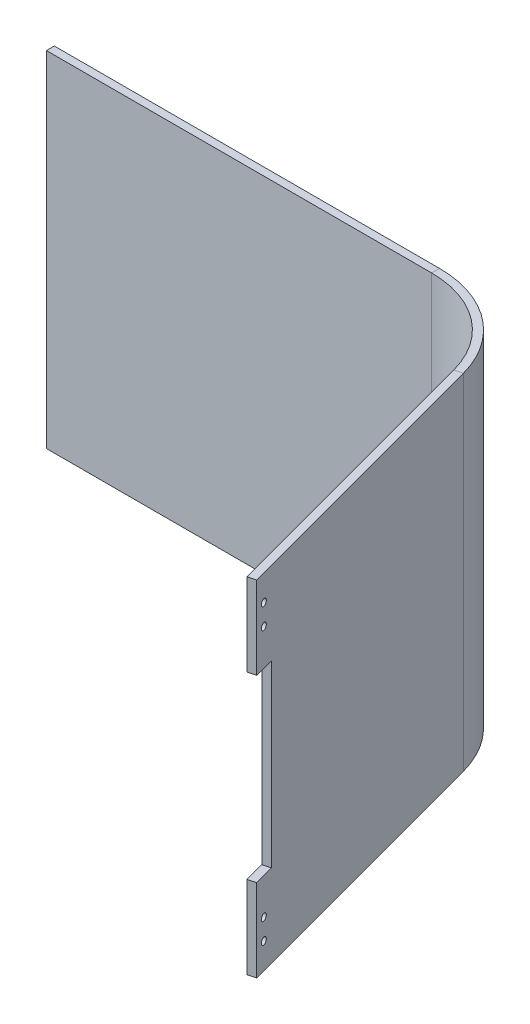
ISO-10303-21;
HEADER;
FILE_DESCRIPTION(('STEP AP214'),'2;1');
FILE_NAME('part.step','',(''),(''),'','','');
FILE_SCHEMA(('AUTOMOTIVE_DESIGN { 1 0 10303 214 1 1 1 1 }'));
ENDSEC;
DATA;
#1=APPLICATION_CONTEXT('core data for automotive mechanical design processes');
#2=APPLICATION_PROTOCOL_DEFINITION('international standard','automotive_design',2000,#1);
#3=PRODUCT_CONTEXT('',#1,'mechanical');
#4=PRODUCT('Part','Part','',(#3));
#5=PRODUCT_RELATED_PRODUCT_CATEGORY('part','',(#4));
#6=PRODUCT_DEFINITION_FORMATION('','',#4);
#7=PRODUCT_DEFINITION_CONTEXT('part definition',#1,'design');
#8=PRODUCT_DEFINITION('design','',#6,#7);
#9=PRODUCT_DEFINITION_SHAPE('','',#8);
#10=(LENGTH_UNIT() NAMED_UNIT(*) SI_UNIT(.MILLI.,.METRE.));
#11=(NAMED_UNIT(*) PLANE_ANGLE_UNIT() SI_UNIT($,.RADIAN.));
#12=(NAMED_UNIT(*) SI_UNIT($,.STERADIAN.) SOLID_ANGLE_UNIT());
#13=UNCERTAINTY_MEASURE_WITH_UNIT(LENGTH_MEASURE(1.E-05),#10,'distance_accuracy_value','');
#14=(GEOMETRIC_REPRESENTATION_CONTEXT(3) GLOBAL_UNCERTAINTY_ASSIGNED_CONTEXT((#13)) GLOBAL_UNIT_ASSIGNED_CONTEXT((#10,
#11,#12)) REPRESENTATION_CONTEXT('',''));
#15=CARTESIAN_POINT('',(0.,0.,0.));
#16=DIRECTION('',(0.,0.,1.));
#17=DIRECTION('',(1.,0.,0.));
#18=AXIS2_PLACEMENT_3D('',#15,#16,#17);
#19=CARTESIAN_POINT('',(177.873428038047,0.,-217.199269024253));
#20=DIRECTION('',(0.965925826289069,0.,-0.258819045102518));
#21=DIRECTION('',(-0.258819045102518,0.,-0.965925826289069));
#22=AXIS2_PLACEMENT_3D('',#19,#20,#21);
#23=PLANE('',#22);
#24=CARTESIAN_POINT('',(282.811609874865,151.4,174.43535724466));
#25=DIRECTION('',(-0.965925826289069,0.,0.258819045102518));
#26=DIRECTION('',(-0.258819045102518,0.,-0.965925826289069));
#27=AXIS2_PLACEMENT_3D('',#24,#25,#26);
#28=CIRCLE('',#27,1.75000000000002);
#29=CARTESIAN_POINT('',(282.358676545936,151.4,172.744987048654));
#30=VERTEX_POINT('',#29);
#31=EDGE_CURVE('E198',#30,#30,#28,.T.);
#32=ORIENTED_EDGE('',*,*,#31,.T.);
#33=EDGE_LOOP('',(#32));
#34=FACE_BOUND('',#33,.T.);
#35=CARTESIAN_POINT('',(282.811609874865,161.9,174.43535724466));
#36=DIRECTION('',(-0.965925826289069,0.,0.258819045102518));
#37=DIRECTION('',(-0.258819045102518,0.,-0.965925826289069));
#38=AXIS2_PLACEMENT_3D('',#35,#36,#37);
#39=CIRCLE('',#38,1.75000000000002);
#40=CARTESIAN_POINT('',(282.358676545936,161.9,172.744987048654));
#41=VERTEX_POINT('',#40);
#42=EDGE_CURVE('E202',#41,#41,#39,.T.);
#43=ORIENTED_EDGE('',*,*,#42,.T.);
#44=EDGE_LOOP('',(#43));
#45=FACE_BOUND('',#44,.T.);
#46=CARTESIAN_POINT('',(282.811609874865,23.6000000000002,174.43535724466));
#47=DIRECTION('',(0.965925826289069,0.,-0.258819045102518));
#48=DIRECTION('',(-0.258819045102518,0.,-0.965925826289069));
#49=AXIS2_PLACEMENT_3D('',#46,#47,#48);
#50=CIRCLE('',#49,1.75000000000002);
#51=CARTESIAN_POINT('',(282.358676545936,23.6000000000002,172.744987048654));
#52=VERTEX_POINT('',#51);
#53=EDGE_CURVE('E206',#52,#52,#50,.T.);
#54=ORIENTED_EDGE('',*,*,#53,.F.);
#55=EDGE_LOOP('',(#54));
#56=FACE_BOUND('',#55,.T.);
#57=CARTESIAN_POINT('',(282.811609874865,13.1000000000002,174.43535724466));
#58=DIRECTION('',(0.965925826289069,0.,-0.258819045102518));
#59=DIRECTION('',(-0.258819045102518,0.,-0.965925826289069));
#60=AXIS2_PLACEMENT_3D('',#57,#58,#59);
#61=CIRCLE('',#60,1.75000000000002);
#62=CARTESIAN_POINT('',(282.358676545936,13.1000000000002,172.744987048654));
#63=VERTEX_POINT('',#62);
#64=EDGE_CURVE('E210',#63,#63,#61,.T.);
#65=ORIENTED_EDGE('',*,*,#64,.F.);
#66=EDGE_LOOP('',(#65));
#67=FACE_BOUND('',#66,.T.);
#68=DIRECTION('',(0.,-1.,0.));
#69=VECTOR('',#68,1.);
#70=CARTESIAN_POINT('',(284.144527957141,0.,179.409875250039));
#71=LINE('',#70,#69);
#72=CARTESIAN_POINT('',(284.144527957141,175.,179.409875250039));
#73=VERTEX_POINT('',#72);
#74=CARTESIAN_POINT('',(284.144527957141,133.05,179.409875250039));
#75=VERTEX_POINT('',#74);
#76=EDGE_CURVE('E225',#73,#75,#71,.T.);
#77=ORIENTED_EDGE('',*,*,#76,.T.);
#78=DIRECTION('',(-0.258819045102518,0.,-0.965925826289069));
#79=VECTOR('',#78,1.);
#80=CARTESIAN_POINT('',(177.873428038047,133.05,-217.199269024253));
#81=LINE('',#80,#79);
#82=CARTESIAN_POINT('',(281.401046079054,133.05,169.171061491375));
#83=VERTEX_POINT('',#82);
#84=EDGE_CURVE('E179',#83,#75,#81,.F.);
#85=ORIENTED_EDGE('',*,*,#84,.F.);
#86=DIRECTION('',(0.,1.,0.));
#87=VECTOR('',#86,1.);
#88=CARTESIAN_POINT('',(281.401046079054,0.,169.171061491375));
#89=LINE('',#88,#87);
#90=CARTESIAN_POINT('',(281.401046079054,41.9499999999998,169.171061491375));
#91=VERTEX_POINT('',#90);
#92=EDGE_CURVE('E241',#91,#83,#89,.T.);
#93=ORIENTED_EDGE('',*,*,#92,.F.);
#94=DIRECTION('',(-0.258819045102518,0.,-0.965925826289069));
#95=VECTOR('',#94,1.);
#96=CARTESIAN_POINT('',(177.873428038047,41.9499999999998,-217.199269024253));
#97=LINE('',#96,#95);
#98=CARTESIAN_POINT('',(284.144527957141,41.9499999999998,179.409875250039));
#99=VERTEX_POINT('',#98);
#100=EDGE_CURVE('E190',#99,#91,#97,.T.);
#101=ORIENTED_EDGE('',*,*,#100,.F.);
#102=CARTESIAN_POINT('',(284.144527957141,0.,179.409875250039));
#103=VERTEX_POINT('',#102);
#104=EDGE_CURVE('E240',#99,#103,#71,.T.);
#105=ORIENTED_EDGE('',*,*,#104,.T.);
#106=DIRECTION('',(0.258819045102518,0.,0.965925826289069));
#107=VECTOR('',#106,1.);
#108=CARTESIAN_POINT('',(177.873428038047,0.,-217.199269024253));
#109=LINE('',#108,#107);
#110=CARTESIAN_POINT('',(245.724337268746,0.,36.023771564464));
#111=VERTEX_POINT('',#110);
#112=EDGE_CURVE('E267',#111,#103,#109,.T.);
#113=ORIENTED_EDGE('',*,*,#112,.F.);
#114=DIRECTION('',(0.,1.,0.));
#115=VECTOR('',#114,1.);
#116=CARTESIAN_POINT('',(245.724337268746,0.,36.023771564464));
#117=LINE('',#116,#115);
#118=CARTESIAN_POINT('',(245.724337268746,175.,36.023771564464));
#119=VERTEX_POINT('',#118);
#120=EDGE_CURVE('E258',#111,#119,#117,.T.);
#121=ORIENTED_EDGE('',*,*,#120,.T.);
#122=DIRECTION('',(-0.258819045102518,0.,-0.965925826289069));
#123=VECTOR('',#122,1.);
#124=CARTESIAN_POINT('',(177.873428038047,175.,-217.199269024253));
#125=LINE('',#124,#123);
#126=EDGE_CURVE('E253',#73,#119,#125,.T.);
#127=ORIENTED_EDGE('',*,*,#126,.F.);
#128=EDGE_LOOP('',(#77,#85,#93,#101,#105,#113,#121,#127));
#129=FACE_BOUND('',#128,.T.);
#130=ADVANCED_FACE('F58',(#34,#45,#56,#67,#129),#23,.T.);
#131=CARTESIAN_POINT('',(174.009724732891,0.,-216.163992843842));
#132=DIRECTION('',(0.965925826289069,0.,-0.258819045102518));
#133=DIRECTION('',(-0.258819045102518,0.,-0.965925826289069));
#134=AXIS2_PLACEMENT_3D('',#131,#132,#133);
#135=PLANE('',#134);
#136=CARTESIAN_POINT('',(278.947906569709,151.4,175.47063342507));
#137=DIRECTION('',(0.965925826289069,0.,-0.258819045102518));
#138=DIRECTION('',(-0.258819045102518,0.,-0.965925826289069));
#139=AXIS2_PLACEMENT_3D('',#136,#137,#138);
#140=CIRCLE('',#139,1.75000000000002);
#141=CARTESIAN_POINT('',(278.49497324078,151.4,173.780263229064));
#142=VERTEX_POINT('',#141);
#143=EDGE_CURVE('E62',#142,#142,#140,.F.);
#144=ORIENTED_EDGE('',*,*,#143,.F.);
#145=EDGE_LOOP('',(#144));
#146=FACE_BOUND('',#145,.T.);
#147=CARTESIAN_POINT('',(278.947906569709,161.9,175.47063342507));
#148=DIRECTION('',(0.965925826289069,0.,-0.258819045102518));
#149=DIRECTION('',(-0.258819045102518,0.,-0.965925826289069));
#150=AXIS2_PLACEMENT_3D('',#147,#148,#149);
#151=CIRCLE('',#150,1.75000000000002);
#152=CARTESIAN_POINT('',(278.49497324078,161.9,173.780263229064));
#153=VERTEX_POINT('',#152);
#154=EDGE_CURVE('E205',#153,#153,#151,.F.);
#155=ORIENTED_EDGE('',*,*,#154,.F.);
#156=EDGE_LOOP('',(#155));
#157=FACE_BOUND('',#156,.T.);
#158=CARTESIAN_POINT('',(278.947906569709,23.6000000000002,175.47063342507));
#159=DIRECTION('',(0.965925826289069,0.,-0.258819045102518));
#160=DIRECTION('',(-0.258819045102518,0.,-0.965925826289069));
#161=AXIS2_PLACEMENT_3D('',#158,#159,#160);
#162=CIRCLE('',#161,1.75000000000002);
#163=CARTESIAN_POINT('',(278.49497324078,23.6000000000002,173.780263229064));
#164=VERTEX_POINT('',#163);
#165=EDGE_CURVE('E209',#164,#164,#162,.T.);
#166=ORIENTED_EDGE('',*,*,#165,.T.);
#167=EDGE_LOOP('',(#166));
#168=FACE_BOUND('',#167,.T.);
#169=CARTESIAN_POINT('',(278.947906569709,13.1000000000002,175.47063342507));
#170=DIRECTION('',(0.965925826289069,0.,-0.258819045102518));
#171=DIRECTION('',(-0.258819045102518,0.,-0.965925826289069));
#172=AXIS2_PLACEMENT_3D('',#169,#170,#171);
#173=CIRCLE('',#172,1.75000000000002);
#174=CARTESIAN_POINT('',(278.49497324078,13.1000000000002,173.780263229064));
#175=VERTEX_POINT('',#174);
#176=EDGE_CURVE('E213',#175,#175,#173,.T.);
#177=ORIENTED_EDGE('',*,*,#176,.T.);
#178=EDGE_LOOP('',(#177));
#179=FACE_BOUND('',#178,.T.);
#180=DIRECTION('',(0.258819045102518,0.,0.965925826289069));
#181=VECTOR('',#180,1.);
#182=CARTESIAN_POINT('',(174.009724732891,133.05,-216.163992843842));
#183=LINE('',#182,#181);
#184=CARTESIAN_POINT('',(277.537342773898,133.05,170.206337671785));
#185=VERTEX_POINT('',#184);
#186=CARTESIAN_POINT('',(280.280824651984,133.05,180.445151430449));
#187=VERTEX_POINT('',#186);
#188=EDGE_CURVE('E182',#185,#187,#183,.T.);
#189=ORIENTED_EDGE('',*,*,#188,.T.);
#190=DIRECTION('',(0.,-1.,0.));
#191=VECTOR('',#190,1.);
#192=CARTESIAN_POINT('',(280.280824651984,0.,180.445151430449));
#193=LINE('',#192,#191);
#194=CARTESIAN_POINT('',(280.280824651984,175.,180.445151430449));
#195=VERTEX_POINT('',#194);
#196=EDGE_CURVE('E255',#195,#187,#193,.T.);
#197=ORIENTED_EDGE('',*,*,#196,.F.);
#198=DIRECTION('',(-0.258819045102518,0.,-0.965925826289069));
#199=VECTOR('',#198,1.);
#200=CARTESIAN_POINT('',(174.009724732891,175.,-216.163992843842));
#201=LINE('',#200,#199);
#202=CARTESIAN_POINT('',(241.86063396359,175.,37.0590477448741));
#203=VERTEX_POINT('',#202);
#204=EDGE_CURVE('E268',#195,#203,#201,.T.);
#205=ORIENTED_EDGE('',*,*,#204,.T.);
#206=DIRECTION('',(0.,1.,0.));
#207=VECTOR('',#206,1.);
#208=CARTESIAN_POINT('',(241.86063396359,0.,37.0590477448741));
#209=LINE('',#208,#207);
#210=CARTESIAN_POINT('',(241.86063396359,0.,37.0590477448741));
#211=VERTEX_POINT('',#210);
#212=EDGE_CURVE('E67',#211,#203,#209,.T.);
#213=ORIENTED_EDGE('',*,*,#212,.F.);
#214=DIRECTION('',(0.258819045102518,0.,0.965925826289069));
#215=VECTOR('',#214,1.);
#216=CARTESIAN_POINT('',(174.009724732891,0.,-216.163992843842));
#217=LINE('',#216,#215);
#218=CARTESIAN_POINT('',(280.280824651984,0.,180.445151430449));
#219=VERTEX_POINT('',#218);
#220=EDGE_CURVE('E247',#211,#219,#217,.T.);
#221=ORIENTED_EDGE('',*,*,#220,.T.);
#222=DIRECTION('',(0.,-1.,0.));
#223=VECTOR('',#222,1.);
#224=CARTESIAN_POINT('',(280.280824651984,0.,180.445151430449));
#225=LINE('',#224,#223);
#226=CARTESIAN_POINT('',(280.280824651984,41.9499999999998,180.445151430449));
#227=VERTEX_POINT('',#226);
#228=EDGE_CURVE('E250',#227,#219,#225,.T.);
#229=ORIENTED_EDGE('',*,*,#228,.F.);
#230=DIRECTION('',(-0.258819045102518,0.,-0.965925826289069));
#231=VECTOR('',#230,1.);
#232=CARTESIAN_POINT('',(174.009724732891,41.9500000000001,-216.163992843842));
#233=LINE('',#232,#231);
#234=CARTESIAN_POINT('',(277.537342773898,41.9499999999998,170.206337671785));
#235=VERTEX_POINT('',#234);
#236=EDGE_CURVE('E75',#227,#235,#233,.T.);
#237=ORIENTED_EDGE('',*,*,#236,.T.);
#238=DIRECTION('',(0.,1.,0.));
#239=VECTOR('',#238,1.);
#240=CARTESIAN_POINT('',(277.537342773898,0.,170.206337671785));
#241=LINE('',#240,#239);
#242=EDGE_CURVE('E252',#235,#185,#241,.T.);
#243=ORIENTED_EDGE('',*,*,#242,.T.);
#244=EDGE_LOOP('',(#189,#197,#205,#213,#221,#229,#237,#243));
#245=FACE_BOUND('',#244,.T.);
#246=ADVANCED_FACE('F283',(#146,#157,#168,#179,#245),#135,.F.);
#247=CARTESIAN_POINT('',(134.426024882335,0.,219.526827240929));
#248=DIRECTION('',(0.258819045102518,0.,0.965925826289069));
#249=DIRECTION('',(0.965925826289069,0.,-0.258819045102518));
#250=AXIS2_PLACEMENT_3D('',#247,#248,#249);
#251=PLANE('',#250);
#252=ORIENTED_EDGE('',*,*,#196,.T.);
#253=DIRECTION('',(-0.965925826289069,0.,0.258819045102518));
#254=VECTOR('',#253,1.);
#255=CARTESIAN_POINT('',(280.280824651984,133.05,180.445151430449));
#256=LINE('',#255,#254);
#257=EDGE_CURVE('E185',#187,#75,#256,.F.);
#258=ORIENTED_EDGE('',*,*,#257,.T.);
#259=ORIENTED_EDGE('',*,*,#76,.F.);
#260=DIRECTION('',(0.965925826289069,0.,-0.258819045102518));
#261=VECTOR('',#260,1.);
#262=CARTESIAN_POINT('',(134.426024882335,175.,219.526827240929));
#263=LINE('',#262,#261);
#264=EDGE_CURVE('E243',#195,#73,#263,.T.);
#265=ORIENTED_EDGE('',*,*,#264,.F.);
#266=EDGE_LOOP('',(#252,#258,#259,#265));
#267=FACE_BOUND('',#266,.T.);
#268=ADVANCED_FACE('F286',(#267),#251,.T.);
#269=ORIENTED_EDGE('',*,*,#104,.F.);
#270=DIRECTION('',(-0.965925826289069,0.,0.258819045102518));
#271=VECTOR('',#270,1.);
#272=CARTESIAN_POINT('',(280.280824651984,41.9499999999998,180.445151430449));
#273=LINE('',#272,#271);
#274=EDGE_CURVE('E193',#227,#99,#273,.F.);
#275=ORIENTED_EDGE('',*,*,#274,.F.);
#276=ORIENTED_EDGE('',*,*,#228,.T.);
#277=DIRECTION('',(0.965925826289069,0.,-0.258819045102518));
#278=VECTOR('',#277,1.);
#279=CARTESIAN_POINT('',(134.426024882335,0.,219.526827240929));
#280=LINE('',#279,#278);
#281=EDGE_CURVE('E244',#219,#103,#280,.T.);
#282=ORIENTED_EDGE('',*,*,#281,.T.);
#283=EDGE_LOOP('',(#269,#275,#276,#282));
#284=FACE_BOUND('',#283,.T.);
#285=ADVANCED_FACE('F325',(#284),#251,.T.);
#286=CARTESIAN_POINT('',(177.873428038047,175.,-217.199269024253));
#287=DIRECTION('',(0.,1.,0.));
#288=DIRECTION('',(-0.965925826289069,0.,0.258819045102518));
#289=AXIS2_PLACEMENT_3D('',#286,#287,#288);
#290=PLANE('',#289);
#291=ORIENTED_EDGE('',*,*,#126,.T.);
#292=DIRECTION('',(-0.965925826289069,0.,0.258819045102518));
#293=VECTOR('',#292,1.);
#294=CARTESIAN_POINT('',(245.724337268746,175.,36.023771564464));
#295=LINE('',#294,#293);
#296=EDGE_CURVE('E14',#119,#203,#295,.T.);
#297=ORIENTED_EDGE('',*,*,#296,.T.);
#298=ORIENTED_EDGE('',*,*,#204,.F.);
#299=ORIENTED_EDGE('',*,*,#264,.T.);
#300=EDGE_LOOP('',(#291,#297,#298,#299));
#301=FACE_BOUND('',#300,.T.);
#302=ADVANCED_FACE('F60',(#301),#290,.T.);
#303=CARTESIAN_POINT('',(177.873428038047,0.,-217.199269024253));
#304=DIRECTION('',(0.,-1.,0.));
#305=DIRECTION('',(0.965925826289069,0.,-0.258819045102518));
#306=AXIS2_PLACEMENT_3D('',#303,#304,#305);
#307=PLANE('',#306);
#308=ORIENTED_EDGE('',*,*,#220,.F.);
#309=DIRECTION('',(0.965925826289069,0.,-0.258819045102518));
#310=VECTOR('',#309,1.);
#311=CARTESIAN_POINT('',(245.724337268746,0.,36.023771564464));
#312=LINE('',#311,#310);
#313=EDGE_CURVE('E261',#211,#111,#312,.T.);
#314=ORIENTED_EDGE('',*,*,#313,.T.);
#315=ORIENTED_EDGE('',*,*,#112,.T.);
#316=ORIENTED_EDGE('',*,*,#281,.F.);
#317=EDGE_LOOP('',(#308,#314,#315,#316));
#318=FACE_BOUND('',#317,.T.);
#319=ADVANCED_FACE('F322',(#318),#307,.T.);
#320=CARTESIAN_POINT('',(131.682543004248,0.,209.288013482265));
#321=DIRECTION('',(-0.258819045102518,0.,-0.965925826289069));
#322=DIRECTION('',(-0.965925826289069,0.,0.258819045102518));
#323=AXIS2_PLACEMENT_3D('',#320,#321,#322);
#324=PLANE('',#323);
#325=ORIENTED_EDGE('',*,*,#242,.F.);
#326=DIRECTION('',(-0.965925826289069,0.,0.258819045102518));
#327=VECTOR('',#326,1.);
#328=CARTESIAN_POINT('',(277.537342773898,41.9499999999998,170.206337671785));
#329=LINE('',#328,#327);
#330=EDGE_CURVE('E195',#235,#91,#329,.F.);
#331=ORIENTED_EDGE('',*,*,#330,.T.);
#332=ORIENTED_EDGE('',*,*,#92,.T.);
#333=DIRECTION('',(-0.965925826289069,0.,0.258819045102518));
#334=VECTOR('',#333,1.);
#335=CARTESIAN_POINT('',(277.537342773898,133.05,170.206337671785));
#336=LINE('',#335,#334);
#337=EDGE_CURVE('E181',#185,#83,#336,.F.);
#338=ORIENTED_EDGE('',*,*,#337,.F.);
#339=EDGE_LOOP('',(#325,#331,#332,#338));
#340=FACE_BOUND('',#339,.T.);
#341=ADVANCED_FACE('F329',(#340),#324,.F.);
#342=CARTESIAN_POINT('',(0.,0.,-4.));
#343=DIRECTION('',(0.,0.,-1.));
#344=DIRECTION('',(-1.,0.,0.));
#345=AXIS2_PLACEMENT_3D('',#342,#343,#344);
#346=PLANE('',#345);
#347=DIRECTION('',(0.,1.,0.));
#348=VECTOR('',#347,1.);
#349=CARTESIAN_POINT('',(193.564342649136,0.,-4.));
#350=LINE('',#349,#348);
#351=CARTESIAN_POINT('',(193.564342649136,0.,-4.));
#352=VERTEX_POINT('',#351);
#353=CARTESIAN_POINT('',(193.564342649136,175.,-4.));
#354=VERTEX_POINT('',#353);
#355=EDGE_CURVE('E219',#352,#354,#350,.T.);
#356=ORIENTED_EDGE('',*,*,#355,.F.);
#357=DIRECTION('',(1.,0.,0.));
#358=VECTOR('',#357,1.);
#359=CARTESIAN_POINT('',(0.,0.,-4.));
#360=LINE('',#359,#358);
#361=CARTESIAN_POINT('',(-2.,0.,-4.));
#362=VERTEX_POINT('',#361);
#363=EDGE_CURVE('E230',#362,#352,#360,.T.);
#364=ORIENTED_EDGE('',*,*,#363,.F.);
#365=DIRECTION('',(0.,-1.,0.));
#366=VECTOR('',#365,1.);
#367=CARTESIAN_POINT('',(-2.,179.472135955,-4.));
#368=LINE('',#367,#366);
#369=CARTESIAN_POINT('',(-2.,175.,-4.));
#370=VERTEX_POINT('',#369);
#371=EDGE_CURVE('E170',#370,#362,#368,.T.);
#372=ORIENTED_EDGE('',*,*,#371,.F.);
#373=DIRECTION('',(-1.,0.,0.));
#374=VECTOR('',#373,1.);
#375=CARTESIAN_POINT('',(0.,175.,-4.));
#376=LINE('',#375,#374);
#377=EDGE_CURVE('E162',#354,#370,#376,.T.);
#378=ORIENTED_EDGE('',*,*,#377,.F.);
#379=EDGE_LOOP('',(#356,#364,#372,#378));
#380=FACE_BOUND('',#379,.T.);
#381=ADVANCED_FACE('F354',(#380),#346,.T.);
#382=CARTESIAN_POINT('',(0.,0.,-4.));
#383=DIRECTION('',(0.,-1.,0.));
#384=DIRECTION('',(0.,0.,-1.));
#385=AXIS2_PLACEMENT_3D('',#382,#383,#384);
#386=PLANE('',#385);
#387=DIRECTION('',(0.,0.,-1.));
#388=VECTOR('',#387,1.);
#389=CARTESIAN_POINT('',(193.564342649136,0.,-4.));
#390=LINE('',#389,#388);
#391=CARTESIAN_POINT('',(193.564342649136,0.,0.));
#392=VERTEX_POINT('',#391);
#393=EDGE_CURVE('E232',#392,#352,#390,.T.);
#394=ORIENTED_EDGE('',*,*,#393,.F.);
#395=DIRECTION('',(1.,0.,0.));
#396=VECTOR('',#395,1.);
#397=CARTESIAN_POINT('',(0.,0.,0.));
#398=LINE('',#397,#396);
#399=CARTESIAN_POINT('',(-2.,0.,0.));
#400=VERTEX_POINT('',#399);
#401=EDGE_CURVE('E228',#400,#392,#398,.T.);
#402=ORIENTED_EDGE('',*,*,#401,.F.);
#403=DIRECTION('',(0.,0.,-1.));
#404=VECTOR('',#403,1.);
#405=CARTESIAN_POINT('',(-2.,0.,0.));
#406=LINE('',#405,#404);
#407=EDGE_CURVE('E174',#400,#362,#406,.T.);
#408=ORIENTED_EDGE('',*,*,#407,.T.);
#409=ORIENTED_EDGE('',*,*,#363,.T.);
#410=EDGE_LOOP('',(#394,#402,#408,#409));
#411=FACE_BOUND('',#410,.T.);
#412=ADVANCED_FACE('F310',(#411),#386,.T.);
#413=CARTESIAN_POINT('',(0.,0.,0.));
#414=DIRECTION('',(0.,0.,-1.));
#415=DIRECTION('',(-1.,0.,0.));
#416=AXIS2_PLACEMENT_3D('',#413,#414,#415);
#417=PLANE('',#416);
#418=ORIENTED_EDGE('',*,*,#401,.T.);
#419=DIRECTION('',(0.,1.,0.));
#420=VECTOR('',#419,1.);
#421=CARTESIAN_POINT('',(193.564342649136,0.,0.));
#422=LINE('',#421,#420);
#423=CARTESIAN_POINT('',(193.564342649136,175.,0.));
#424=VERTEX_POINT('',#423);
#425=EDGE_CURVE('E158',#392,#424,#422,.T.);
#426=ORIENTED_EDGE('',*,*,#425,.T.);
#427=DIRECTION('',(-1.,0.,0.));
#428=VECTOR('',#427,1.);
#429=CARTESIAN_POINT('',(0.,175.,0.));
#430=LINE('',#429,#428);
#431=CARTESIAN_POINT('',(-2.,175.,0.));
#432=VERTEX_POINT('',#431);
#433=EDGE_CURVE('E151',#424,#432,#430,.T.);
#434=ORIENTED_EDGE('',*,*,#433,.T.);
#435=DIRECTION('',(0.,-1.,0.));
#436=VECTOR('',#435,1.);
#437=CARTESIAN_POINT('',(-2.,179.472135955,0.));
#438=LINE('',#437,#436);
#439=EDGE_CURVE('E155',#432,#400,#438,.T.);
#440=ORIENTED_EDGE('',*,*,#439,.T.);
#441=EDGE_LOOP('',(#418,#426,#434,#440));
#442=FACE_BOUND('',#441,.T.);
#443=ADVANCED_FACE('F153',(#442),#417,.F.);
#444=CARTESIAN_POINT('',(0.,175.,-4.));
#445=DIRECTION('',(0.,1.,0.));
#446=DIRECTION('',(0.,0.,1.));
#447=AXIS2_PLACEMENT_3D('',#444,#445,#446);
#448=PLANE('',#447);
#449=DIRECTION('',(0.,0.,1.));
#450=VECTOR('',#449,1.);
#451=CARTESIAN_POINT('',(193.564342649136,175.,-4.));
#452=LINE('',#451,#450);
#453=EDGE_CURVE('E235',#354,#424,#452,.T.);
#454=ORIENTED_EDGE('',*,*,#453,.F.);
#455=ORIENTED_EDGE('',*,*,#377,.T.);
#456=DIRECTION('',(0.,0.,-1.));
#457=VECTOR('',#456,1.);
#458=CARTESIAN_POINT('',(-2.,175.,0.));
#459=LINE('',#458,#457);
#460=EDGE_CURVE('E165',#432,#370,#459,.T.);
#461=ORIENTED_EDGE('',*,*,#460,.F.);
#462=ORIENTED_EDGE('',*,*,#433,.F.);
#463=EDGE_LOOP('',(#454,#455,#461,#462));
#464=FACE_BOUND('',#463,.T.);
#465=ADVANCED_FACE('F166',(#464),#448,.T.);
#466=CARTESIAN_POINT('',(193.564342649136,0.,50.));
#467=DIRECTION('',(0.,-1.,0.));
#468=DIRECTION('',(0.,0.,-1.));
#469=AXIS2_PLACEMENT_3D('',#466,#467,#468);
#470=PLANE('',#469);
#471=ORIENTED_EDGE('',*,*,#313,.F.);
#472=CARTESIAN_POINT('',(193.564342649136,0.,50.));
#473=DIRECTION('',(0.,-1.,0.));
#474=DIRECTION('',(0.,0.,-1.));
#475=AXIS2_PLACEMENT_3D('',#472,#473,#474);
#476=CIRCLE('',#475,50.);
#477=EDGE_CURVE('E220',#211,#392,#476,.F.);
#478=ORIENTED_EDGE('',*,*,#477,.T.);
#479=ORIENTED_EDGE('',*,*,#393,.T.);
#480=CARTESIAN_POINT('',(193.564342649136,0.,50.));
#481=DIRECTION('',(0.,1.,0.));
#482=DIRECTION('',(0.,0.,-1.));
#483=AXIS2_PLACEMENT_3D('',#480,#481,#482);
#484=CIRCLE('',#483,54.);
#485=EDGE_CURVE('E214',#111,#352,#484,.T.);
#486=ORIENTED_EDGE('',*,*,#485,.F.);
#487=EDGE_LOOP('',(#471,#478,#479,#486));
#488=FACE_BOUND('',#487,.T.);
#489=ADVANCED_FACE('F306',(#488),#470,.T.);
#490=CARTESIAN_POINT('',(193.564342649136,175.,50.));
#491=DIRECTION('',(0.,1.,0.));
#492=DIRECTION('',(0.,0.,1.));
#493=AXIS2_PLACEMENT_3D('',#490,#491,#492);
#494=PLANE('',#493);
#495=CARTESIAN_POINT('',(193.564342649136,175.,50.));
#496=DIRECTION('',(0.,-1.,0.));
#497=DIRECTION('',(0.,0.,-1.));
#498=AXIS2_PLACEMENT_3D('',#495,#496,#497);
#499=CIRCLE('',#498,50.);
#500=EDGE_CURVE('E217',#424,#203,#499,.T.);
#501=ORIENTED_EDGE('',*,*,#500,.T.);
#502=ORIENTED_EDGE('',*,*,#296,.F.);
#503=CARTESIAN_POINT('',(193.564342649136,175.,50.));
#504=DIRECTION('',(0.,-1.,0.));
#505=DIRECTION('',(0.,0.,1.));
#506=AXIS2_PLACEMENT_3D('',#503,#504,#505);
#507=CIRCLE('',#506,54.);
#508=EDGE_CURVE('E83',#354,#119,#507,.T.);
#509=ORIENTED_EDGE('',*,*,#508,.F.);
#510=ORIENTED_EDGE('',*,*,#453,.T.);
#511=EDGE_LOOP('',(#501,#502,#509,#510));
#512=FACE_BOUND('',#511,.T.);
#513=ADVANCED_FACE('F318',(#512),#494,.T.);
#514=CARTESIAN_POINT('',(193.564342649136,275.504748841256,50.));
#515=DIRECTION('',(0.,-1.,0.));
#516=DIRECTION('',(0.,0.,-1.));
#517=AXIS2_PLACEMENT_3D('',#514,#515,#516);
#518=CYLINDRICAL_SURFACE('',#517,54.);
#519=ORIENTED_EDGE('',*,*,#355,.T.);
#520=ORIENTED_EDGE('',*,*,#508,.T.);
#521=ORIENTED_EDGE('',*,*,#120,.F.);
#522=ORIENTED_EDGE('',*,*,#485,.T.);
#523=EDGE_LOOP('',(#519,#520,#521,#522));
#524=FACE_BOUND('',#523,.T.);
#525=ADVANCED_FACE('F304',(#524),#518,.T.);
#526=CARTESIAN_POINT('',(193.564342649136,275.504748841256,50.));
#527=DIRECTION('',(0.,-1.,0.));
#528=DIRECTION('',(0.,0.,-1.));
#529=AXIS2_PLACEMENT_3D('',#526,#527,#528);
#530=CYLINDRICAL_SURFACE('',#529,50.);
#531=ORIENTED_EDGE('',*,*,#425,.F.);
#532=ORIENTED_EDGE('',*,*,#477,.F.);
#533=ORIENTED_EDGE('',*,*,#212,.T.);
#534=ORIENTED_EDGE('',*,*,#500,.F.);
#535=EDGE_LOOP('',(#531,#532,#533,#534));
#536=FACE_BOUND('',#535,.T.);
#537=ADVANCED_FACE('F314',(#536),#530,.F.);
#538=CARTESIAN_POINT('',(277.016054917131,13.1000000000002,175.988271515275));
#539=DIRECTION('',(0.965925826289069,0.,-0.258819045102518));
#540=DIRECTION('',(-0.258819045102518,0.,-0.965925826289069));
#541=AXIS2_PLACEMENT_3D('',#538,#539,#540);
#542=CYLINDRICAL_SURFACE('',#541,1.75000000000002);
#543=ORIENTED_EDGE('',*,*,#64,.T.);
#544=EDGE_LOOP('',(#543));
#545=FACE_BOUND('',#544,.T.);
#546=ORIENTED_EDGE('',*,*,#176,.F.);
#547=EDGE_LOOP('',(#546));
#548=FACE_BOUND('',#547,.T.);
#549=ADVANCED_FACE('F406',(#545,#548),#542,.F.);
#550=CARTESIAN_POINT('',(277.016054917131,23.6000000000002,175.988271515275));
#551=DIRECTION('',(0.965925826289069,0.,-0.258819045102518));
#552=DIRECTION('',(-0.258819045102518,0.,-0.965925826289069));
#553=AXIS2_PLACEMENT_3D('',#550,#551,#552);
#554=CYLINDRICAL_SURFACE('',#553,1.75000000000002);
#555=ORIENTED_EDGE('',*,*,#53,.T.);
#556=EDGE_LOOP('',(#555));
#557=FACE_BOUND('',#556,.T.);
#558=ORIENTED_EDGE('',*,*,#165,.F.);
#559=EDGE_LOOP('',(#558));
#560=FACE_BOUND('',#559,.T.);
#561=ADVANCED_FACE('F395',(#557,#560),#554,.F.);
#562=CARTESIAN_POINT('',(277.016054917131,161.9,175.988271515275));
#563=DIRECTION('',(0.965925826289069,0.,-0.258819045102518));
#564=DIRECTION('',(-0.258819045102518,0.,-0.965925826289069));
#565=AXIS2_PLACEMENT_3D('',#562,#563,#564);
#566=CYLINDRICAL_SURFACE('',#565,1.75000000000002);
#567=ORIENTED_EDGE('',*,*,#42,.F.);
#568=EDGE_LOOP('',(#567));
#569=FACE_BOUND('',#568,.T.);
#570=ORIENTED_EDGE('',*,*,#154,.T.);
#571=EDGE_LOOP('',(#570));
#572=FACE_BOUND('',#571,.T.);
#573=ADVANCED_FACE('F281',(#569,#572),#566,.F.);
#574=CARTESIAN_POINT('',(277.016054917131,151.4,175.988271515275));
#575=DIRECTION('',(0.965925826289069,0.,-0.258819045102518));
#576=DIRECTION('',(-0.258819045102518,0.,-0.965925826289069));
#577=AXIS2_PLACEMENT_3D('',#574,#575,#576);
#578=CYLINDRICAL_SURFACE('',#577,1.75000000000002);
#579=ORIENTED_EDGE('',*,*,#31,.F.);
#580=EDGE_LOOP('',(#579));
#581=FACE_BOUND('',#580,.T.);
#582=ORIENTED_EDGE('',*,*,#143,.T.);
#583=EDGE_LOOP('',(#582));
#584=FACE_BOUND('',#583,.T.);
#585=ADVANCED_FACE('F338',(#581,#584),#578,.F.);
#586=CARTESIAN_POINT('',(174.009724732891,41.9500000000001,-216.163992843842));
#587=DIRECTION('',(0.,-1.,0.));
#588=DIRECTION('',(-0.258819045102518,0.,-0.965925826289069));
#589=AXIS2_PLACEMENT_3D('',#586,#587,#588);
#590=PLANE('',#589);
#591=ORIENTED_EDGE('',*,*,#330,.F.);
#592=ORIENTED_EDGE('',*,*,#236,.F.);
#593=ORIENTED_EDGE('',*,*,#274,.T.);
#594=ORIENTED_EDGE('',*,*,#100,.T.);
#595=EDGE_LOOP('',(#591,#592,#593,#594));
#596=FACE_BOUND('',#595,.T.);
#597=ADVANCED_FACE('F327',(#596),#590,.F.);
#598=CARTESIAN_POINT('',(174.009724732891,133.05,-216.163992843842));
#599=DIRECTION('',(0.,1.,0.));
#600=DIRECTION('',(0.258819045102518,0.,0.965925826289069));
#601=AXIS2_PLACEMENT_3D('',#598,#599,#600);
#602=PLANE('',#601);
#603=ORIENTED_EDGE('',*,*,#257,.F.);
#604=ORIENTED_EDGE('',*,*,#188,.F.);
#605=ORIENTED_EDGE('',*,*,#337,.T.);
#606=ORIENTED_EDGE('',*,*,#84,.T.);
#607=EDGE_LOOP('',(#603,#604,#605,#606));
#608=FACE_BOUND('',#607,.T.);
#609=ADVANCED_FACE('F330',(#608),#602,.F.);
#610=CARTESIAN_POINT('',(-2.,179.472135955,0.));
#611=DIRECTION('',(-1.,0.,0.));
#612=DIRECTION('',(0.,0.,1.));
#613=AXIS2_PLACEMENT_3D('',#610,#611,#612);
#614=PLANE('',#613);
#615=ORIENTED_EDGE('',*,*,#439,.F.);
#616=ORIENTED_EDGE('',*,*,#460,.T.);
#617=ORIENTED_EDGE('',*,*,#371,.T.);
#618=ORIENTED_EDGE('',*,*,#407,.F.);
#619=EDGE_LOOP('',(#615,#616,#617,#618));
#620=FACE_BOUND('',#619,.T.);
#621=ADVANCED_FACE('F172',(#620),#614,.T.);
#622=CLOSED_SHELL('',(#130,#246,#268,#285,#302,#319,#341,#381,#412,#443,#465,#489,#513,#525,
#537,#549,#561,#573,#585,#597,#609,#621));
#623=MANIFOLD_SOLID_BREP('B2',#622);
#624=ADVANCED_BREP_SHAPE_REPRESENTATION('',(#18,#623),#14);
#625=SHAPE_DEFINITION_REPRESENTATION(#9,#624);
ENDSEC;
END-ISO-10303-21;
